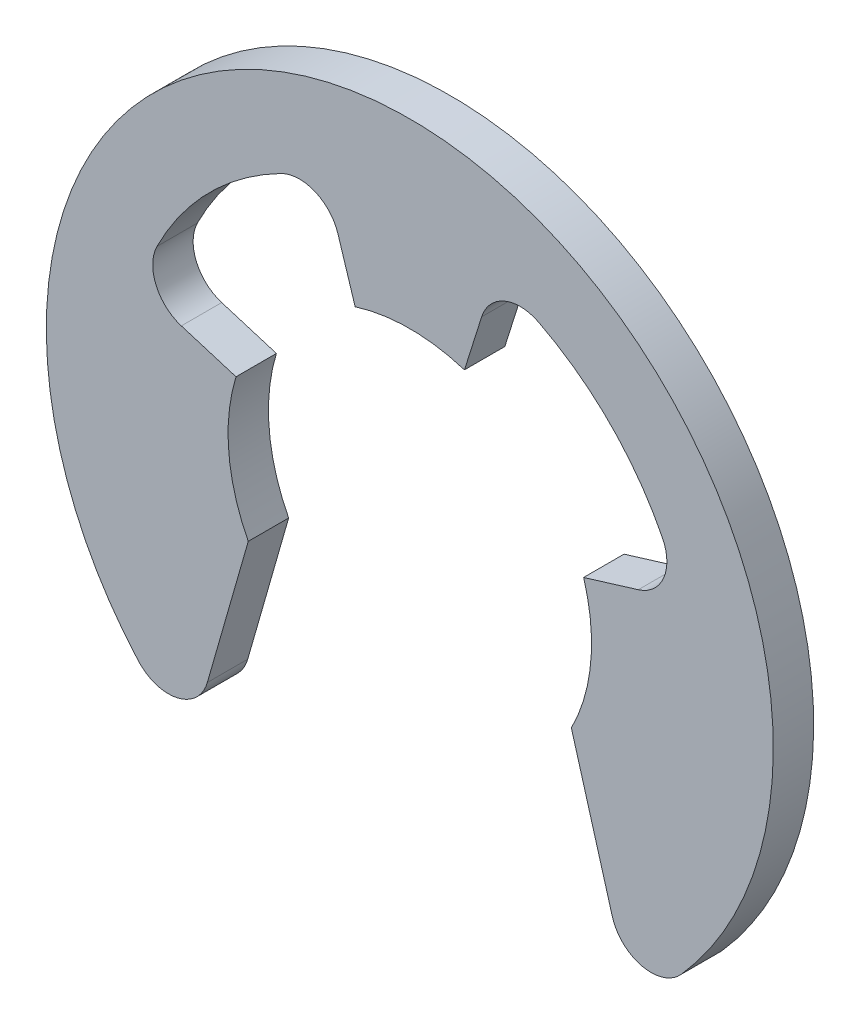
ISO-10303-21;
HEADER;
FILE_DESCRIPTION(('STEP AP214'),'2;1');
FILE_NAME('part.step','',(''),(''),'','','');
FILE_SCHEMA(('AUTOMOTIVE_DESIGN { 1 0 10303 214 1 1 1 1 }'));
ENDSEC;
DATA;
#1=APPLICATION_CONTEXT('core data for automotive mechanical design processes');
#2=APPLICATION_PROTOCOL_DEFINITION('international standard','automotive_design',2000,#1);
#3=PRODUCT_CONTEXT('',#1,'mechanical');
#4=PRODUCT('Part','Part','',(#3));
#5=PRODUCT_RELATED_PRODUCT_CATEGORY('part','',(#4));
#6=PRODUCT_DEFINITION_FORMATION('','',#4);
#7=PRODUCT_DEFINITION_CONTEXT('part definition',#1,'design');
#8=PRODUCT_DEFINITION('design','',#6,#7);
#9=PRODUCT_DEFINITION_SHAPE('','',#8);
#10=(LENGTH_UNIT() NAMED_UNIT(*) SI_UNIT(.MILLI.,.METRE.));
#11=(NAMED_UNIT(*) PLANE_ANGLE_UNIT() SI_UNIT($,.RADIAN.));
#12=(NAMED_UNIT(*) SI_UNIT($,.STERADIAN.) SOLID_ANGLE_UNIT());
#13=UNCERTAINTY_MEASURE_WITH_UNIT(LENGTH_MEASURE(1.E-05),#10,'distance_accuracy_value','');
#14=(GEOMETRIC_REPRESENTATION_CONTEXT(3) GLOBAL_UNCERTAINTY_ASSIGNED_CONTEXT((#13)) GLOBAL_UNIT_ASSIGNED_CONTEXT((#10,
#11,#12)) REPRESENTATION_CONTEXT('',''));
#15=CARTESIAN_POINT('',(0.,0.,0.));
#16=DIRECTION('',(0.,0.,1.));
#17=DIRECTION('',(1.,0.,0.));
#18=AXIS2_PLACEMENT_3D('',#15,#16,#17);
#19=CARTESIAN_POINT('',(0.,0.,1.));
#20=DIRECTION('',(0.,0.,-1.));
#21=DIRECTION('',(-1.,0.,0.));
#22=AXIS2_PLACEMENT_3D('',#19,#20,#21);
#23=CYLINDRICAL_SURFACE('',#22,7.);
#24=CARTESIAN_POINT('',(0.,0.,0.));
#25=DIRECTION('',(0.,0.,1.));
#26=DIRECTION('',(1.,0.,0.));
#27=AXIS2_PLACEMENT_3D('',#24,#25,#26);
#28=CIRCLE('',#27,7.);
#29=CARTESIAN_POINT('',(6.25940411659755,3.1336656019942,0.));
#30=VERTEX_POINT('',#29);
#31=CARTESIAN_POINT('',(3.18816919383231,6.23181973355285,0.));
#32=VERTEX_POINT('',#31);
#33=EDGE_CURVE('E198',#30,#32,#28,.T.);
#34=ORIENTED_EDGE('',*,*,#33,.F.);
#35=DIRECTION('',(0.,0.,-1.));
#36=VECTOR('',#35,1.);
#37=CARTESIAN_POINT('',(6.25940411659755,3.1336656019942,1.));
#38=LINE('',#37,#36);
#39=CARTESIAN_POINT('',(6.25940411659755,3.1336656019942,1.));
#40=VERTEX_POINT('',#39);
#41=EDGE_CURVE('E11',#40,#30,#38,.T.);
#42=ORIENTED_EDGE('',*,*,#41,.F.);
#43=CARTESIAN_POINT('',(0.,0.,1.));
#44=DIRECTION('',(0.,0.,1.));
#45=DIRECTION('',(1.,0.,0.));
#46=AXIS2_PLACEMENT_3D('',#43,#44,#45);
#47=CIRCLE('',#46,7.);
#48=CARTESIAN_POINT('',(3.18816919383231,6.23181973355285,1.));
#49=VERTEX_POINT('',#48);
#50=EDGE_CURVE('E249',#40,#49,#47,.T.);
#51=ORIENTED_EDGE('',*,*,#50,.T.);
#52=DIRECTION('',(0.,0.,-1.));
#53=VECTOR('',#52,1.);
#54=CARTESIAN_POINT('',(3.18816919383231,6.23181973355285,1.));
#55=LINE('',#54,#53);
#56=EDGE_CURVE('E58',#49,#32,#55,.T.);
#57=ORIENTED_EDGE('',*,*,#56,.T.);
#58=EDGE_LOOP('',(#34,#42,#51,#57));
#59=FACE_BOUND('',#58,.T.);
#60=ADVANCED_FACE('F42',(#59),#23,.F.);
#61=CARTESIAN_POINT('',(5.36520352851219,2.6859990874236,1.));
#62=DIRECTION('',(0.,0.,-1.));
#63=DIRECTION('',(-1.,0.,0.));
#64=AXIS2_PLACEMENT_3D('',#61,#62,#63);
#65=CYLINDRICAL_SURFACE('',#64,1.);
#66=CARTESIAN_POINT('',(5.36520352851219,2.6859990874236,0.));
#67=DIRECTION('',(0.,0.,1.));
#68=DIRECTION('',(1.,0.,0.));
#69=AXIS2_PLACEMENT_3D('',#66,#67,#68);
#70=CIRCLE('',#69,1.);
#71=CARTESIAN_POINT('',(5.65757523323492,1.72969433146056,0.));
#72=VERTEX_POINT('',#71);
#73=EDGE_CURVE('E200',#30,#72,#70,.F.);
#74=ORIENTED_EDGE('',*,*,#73,.T.);
#75=DIRECTION('',(0.,0.,-1.));
#76=VECTOR('',#75,1.);
#77=CARTESIAN_POINT('',(5.65757523323492,1.72969433146056,1.));
#78=LINE('',#77,#76);
#79=CARTESIAN_POINT('',(5.65757523323492,1.72969433146056,1.));
#80=VERTEX_POINT('',#79);
#81=EDGE_CURVE('E50',#80,#72,#78,.T.);
#82=ORIENTED_EDGE('',*,*,#81,.F.);
#83=CARTESIAN_POINT('',(5.36520352851219,2.6859990874236,1.));
#84=DIRECTION('',(0.,0.,1.));
#85=DIRECTION('',(1.,0.,0.));
#86=AXIS2_PLACEMENT_3D('',#83,#84,#85);
#87=CIRCLE('',#86,1.);
#88=EDGE_CURVE('E296',#40,#80,#87,.F.);
#89=ORIENTED_EDGE('',*,*,#88,.F.);
#90=ORIENTED_EDGE('',*,*,#41,.T.);
#91=EDGE_LOOP('',(#74,#82,#89,#90));
#92=FACE_BOUND('',#91,.T.);
#93=ADVANCED_FACE('F285',(#92),#65,.F.);
#94=CARTESIAN_POINT('',(0.,0.,1.));
#95=DIRECTION('',(-0.292371704722737,0.956304755963035,0.));
#96=DIRECTION('',(-0.956304755963035,-0.292371704722737,0.));
#97=AXIS2_PLACEMENT_3D('',#94,#95,#96);
#98=PLANE('',#97);
#99=DIRECTION('',(0.956304755963035,0.292371704722737,0.));
#100=VECTOR('',#99,1.);
#101=CARTESIAN_POINT('',(0.,0.,0.));
#102=LINE('',#101,#100);
#103=CARTESIAN_POINT('',(4.30337140183366,1.31567267125232,0.));
#104=VERTEX_POINT('',#103);
#105=EDGE_CURVE('E203',#104,#72,#102,.T.);
#106=ORIENTED_EDGE('',*,*,#105,.F.);
#107=DIRECTION('',(0.,0.,-1.));
#108=VECTOR('',#107,1.);
#109=CARTESIAN_POINT('',(4.30337140183366,1.31567267125232,1.));
#110=LINE('',#109,#108);
#111=CARTESIAN_POINT('',(4.30337140183366,1.31567267125232,1.));
#112=VERTEX_POINT('',#111);
#113=EDGE_CURVE('E275',#112,#104,#110,.T.);
#114=ORIENTED_EDGE('',*,*,#113,.F.);
#115=DIRECTION('',(0.956304755963035,0.292371704722737,0.));
#116=VECTOR('',#115,1.);
#117=CARTESIAN_POINT('',(0.,0.,1.));
#118=LINE('',#117,#116);
#119=EDGE_CURVE('E282',#112,#80,#118,.T.);
#120=ORIENTED_EDGE('',*,*,#119,.T.);
#121=ORIENTED_EDGE('',*,*,#81,.T.);
#122=EDGE_LOOP('',(#106,#114,#120,#121));
#123=FACE_BOUND('',#122,.T.);
#124=ADVANCED_FACE('F280',(#123),#98,.T.);
#125=CARTESIAN_POINT('',(0.,0.,1.));
#126=DIRECTION('',(0.,0.,-1.));
#127=DIRECTION('',(-1.,0.,0.));
#128=AXIS2_PLACEMENT_3D('',#125,#126,#127);
#129=CYLINDRICAL_SURFACE('',#128,4.5);
#130=CARTESIAN_POINT('',(0.,0.,0.));
#131=DIRECTION('',(0.,0.,1.));
#132=DIRECTION('',(1.,0.,0.));
#133=AXIS2_PLACEMENT_3D('',#130,#131,#132);
#134=CIRCLE('',#133,4.5);
#135=CARTESIAN_POINT('',(4.,-2.06155281280883,0.));
#136=VERTEX_POINT('',#135);
#137=EDGE_CURVE('E206',#136,#104,#134,.T.);
#138=ORIENTED_EDGE('',*,*,#137,.F.);
#139=DIRECTION('',(0.,0.,-1.));
#140=VECTOR('',#139,1.);
#141=CARTESIAN_POINT('',(4.,-2.06155281280883,1.));
#142=LINE('',#141,#140);
#143=CARTESIAN_POINT('',(4.,-2.06155281280883,1.));
#144=VERTEX_POINT('',#143);
#145=EDGE_CURVE('E273',#144,#136,#142,.T.);
#146=ORIENTED_EDGE('',*,*,#145,.F.);
#147=CARTESIAN_POINT('',(0.,0.,1.));
#148=DIRECTION('',(0.,0.,1.));
#149=DIRECTION('',(1.,0.,0.));
#150=AXIS2_PLACEMENT_3D('',#147,#148,#149);
#151=CIRCLE('',#150,4.5);
#152=EDGE_CURVE('E295',#144,#112,#151,.T.);
#153=ORIENTED_EDGE('',*,*,#152,.T.);
#154=ORIENTED_EDGE('',*,*,#113,.T.);
#155=EDGE_LOOP('',(#138,#146,#153,#154));
#156=FACE_BOUND('',#155,.T.);
#157=ADVANCED_FACE('F291',(#156),#129,.F.);
#158=CARTESIAN_POINT('',(3.1498679174421,0.903210091076205,1.));
#159=DIRECTION('',(0.961261695938321,0.275637355816992,0.));
#160=DIRECTION('',(-0.275637355816992,0.961261695938321,0.));
#161=AXIS2_PLACEMENT_3D('',#158,#159,#160);
#162=PLANE('',#161);
#163=DIRECTION('',(0.275637355816992,-0.961261695938321,0.));
#164=VECTOR('',#163,1.);
#165=CARTESIAN_POINT('',(3.1498679174421,0.903210091076205,0.));
#166=LINE('',#165,#164);
#167=CARTESIAN_POINT('',(5.01340745819447,-5.5957246200124,0.));
#168=VERTEX_POINT('',#167);
#169=EDGE_CURVE('E209',#136,#168,#166,.T.);
#170=ORIENTED_EDGE('',*,*,#169,.T.);
#171=DIRECTION('',(0.,0.,-1.));
#172=VECTOR('',#171,1.);
#173=CARTESIAN_POINT('',(5.01340745819447,-5.5957246200124,1.));
#174=LINE('',#173,#172);
#175=CARTESIAN_POINT('',(5.01340745819447,-5.5957246200124,1.));
#176=VERTEX_POINT('',#175);
#177=EDGE_CURVE('E271',#176,#168,#174,.T.);
#178=ORIENTED_EDGE('',*,*,#177,.F.);
#179=DIRECTION('',(0.275637355816992,-0.961261695938321,0.));
#180=VECTOR('',#179,1.);
#181=CARTESIAN_POINT('',(3.1498679174421,0.903210091076205,1.));
#182=LINE('',#181,#180);
#183=EDGE_CURVE('E298',#144,#176,#182,.T.);
#184=ORIENTED_EDGE('',*,*,#183,.F.);
#185=ORIENTED_EDGE('',*,*,#145,.T.);
#186=EDGE_LOOP('',(#170,#178,#184,#185));
#187=FACE_BOUND('',#186,.T.);
#188=ADVANCED_FACE('F358',(#187),#162,.F.);
#189=CARTESIAN_POINT('',(5.97466915413279,-5.32008726419541,1.));
#190=DIRECTION('',(0.,0.,-1.));
#191=DIRECTION('',(-1.,0.,0.));
#192=AXIS2_PLACEMENT_3D('',#189,#190,#191);
#193=CYLINDRICAL_SURFACE('',#192,1.);
#194=CARTESIAN_POINT('',(5.97466915413279,-5.32008726419541,0.));
#195=DIRECTION('',(0.,0.,1.));
#196=DIRECTION('',(1.,0.,0.));
#197=AXIS2_PLACEMENT_3D('',#194,#195,#196);
#198=CIRCLE('',#197,1.);
#199=CARTESIAN_POINT('',(6.72150279839938,-5.98509817221984,0.));
#200=VERTEX_POINT('',#199);
#201=EDGE_CURVE('E212',#200,#168,#198,.F.);
#202=ORIENTED_EDGE('',*,*,#201,.F.);
#203=DIRECTION('',(0.,0.,-1.));
#204=VECTOR('',#203,1.);
#205=CARTESIAN_POINT('',(6.72150279839938,-5.98509817221984,1.));
#206=LINE('',#205,#204);
#207=CARTESIAN_POINT('',(6.72150279839938,-5.98509817221984,1.));
#208=VERTEX_POINT('',#207);
#209=EDGE_CURVE('E269',#208,#200,#206,.T.);
#210=ORIENTED_EDGE('',*,*,#209,.F.);
#211=CARTESIAN_POINT('',(5.97466915413279,-5.32008726419541,1.));
#212=DIRECTION('',(0.,0.,1.));
#213=DIRECTION('',(1.,0.,0.));
#214=AXIS2_PLACEMENT_3D('',#211,#212,#213);
#215=CIRCLE('',#214,1.);
#216=EDGE_CURVE('E304',#208,#176,#215,.F.);
#217=ORIENTED_EDGE('',*,*,#216,.T.);
#218=ORIENTED_EDGE('',*,*,#177,.T.);
#219=EDGE_LOOP('',(#202,#210,#217,#218));
#220=FACE_BOUND('',#219,.T.);
#221=ADVANCED_FACE('F361',(#220),#193,.T.);
#222=CARTESIAN_POINT('',(0.,0.,1.));
#223=DIRECTION('',(0.,0.,-1.));
#224=DIRECTION('',(-1.,0.,0.));
#225=AXIS2_PLACEMENT_3D('',#222,#223,#224);
#226=CYLINDRICAL_SURFACE('',#225,9.);
#227=CARTESIAN_POINT('',(0.,0.,0.));
#228=DIRECTION('',(0.,0.,1.));
#229=DIRECTION('',(1.,0.,0.));
#230=AXIS2_PLACEMENT_3D('',#227,#228,#229);
#231=CIRCLE('',#230,9.);
#232=CARTESIAN_POINT('',(-6.72150279839939,-5.98509817221983,0.));
#233=VERTEX_POINT('',#232);
#234=EDGE_CURVE('E215',#200,#233,#231,.T.);
#235=ORIENTED_EDGE('',*,*,#234,.T.);
#236=DIRECTION('',(0.,0.,-1.));
#237=VECTOR('',#236,1.);
#238=CARTESIAN_POINT('',(-6.72150279839939,-5.98509817221983,1.));
#239=LINE('',#238,#237);
#240=CARTESIAN_POINT('',(-6.72150279839939,-5.98509817221983,1.));
#241=VERTEX_POINT('',#240);
#242=EDGE_CURVE('E267',#241,#233,#239,.T.);
#243=ORIENTED_EDGE('',*,*,#242,.F.);
#244=CARTESIAN_POINT('',(0.,0.,1.));
#245=DIRECTION('',(0.,0.,1.));
#246=DIRECTION('',(1.,0.,0.));
#247=AXIS2_PLACEMENT_3D('',#244,#245,#246);
#248=CIRCLE('',#247,9.);
#249=EDGE_CURVE('E307',#208,#241,#248,.T.);
#250=ORIENTED_EDGE('',*,*,#249,.F.);
#251=ORIENTED_EDGE('',*,*,#209,.T.);
#252=EDGE_LOOP('',(#235,#243,#250,#251));
#253=FACE_BOUND('',#252,.T.);
#254=ADVANCED_FACE('F365',(#253),#226,.T.);
#255=CARTESIAN_POINT('',(-5.97466915413279,-5.32008726419541,1.));
#256=DIRECTION('',(0.,0.,-1.));
#257=DIRECTION('',(-1.,0.,0.));
#258=AXIS2_PLACEMENT_3D('',#255,#256,#257);
#259=CYLINDRICAL_SURFACE('',#258,1.);
#260=CARTESIAN_POINT('',(-5.97466915413279,-5.32008726419541,0.));
#261=DIRECTION('',(0.,0.,1.));
#262=DIRECTION('',(1.,0.,0.));
#263=AXIS2_PLACEMENT_3D('',#260,#261,#262);
#264=CIRCLE('',#263,1.);
#265=CARTESIAN_POINT('',(-5.01340745819447,-5.5957246200124,0.));
#266=VERTEX_POINT('',#265);
#267=EDGE_CURVE('E219',#266,#233,#264,.F.);
#268=ORIENTED_EDGE('',*,*,#267,.F.);
#269=DIRECTION('',(0.,0.,-1.));
#270=VECTOR('',#269,1.);
#271=CARTESIAN_POINT('',(-5.01340745819447,-5.5957246200124,1.));
#272=LINE('',#271,#270);
#273=CARTESIAN_POINT('',(-5.01340745819447,-5.5957246200124,1.));
#274=VERTEX_POINT('',#273);
#275=EDGE_CURVE('E265',#274,#266,#272,.T.);
#276=ORIENTED_EDGE('',*,*,#275,.F.);
#277=CARTESIAN_POINT('',(-5.97466915413279,-5.32008726419541,1.));
#278=DIRECTION('',(0.,0.,1.));
#279=DIRECTION('',(1.,0.,0.));
#280=AXIS2_PLACEMENT_3D('',#277,#278,#279);
#281=CIRCLE('',#280,1.);
#282=EDGE_CURVE('E310',#274,#241,#281,.F.);
#283=ORIENTED_EDGE('',*,*,#282,.T.);
#284=ORIENTED_EDGE('',*,*,#242,.T.);
#285=EDGE_LOOP('',(#268,#276,#283,#284));
#286=FACE_BOUND('',#285,.T.);
#287=ADVANCED_FACE('F369',(#286),#259,.T.);
#288=CARTESIAN_POINT('',(-3.1498679174421,0.903210091076205,1.));
#289=DIRECTION('',(0.961261695938321,-0.275637355816992,0.));
#290=DIRECTION('',(0.275637355816992,0.961261695938321,0.));
#291=AXIS2_PLACEMENT_3D('',#288,#289,#290);
#292=PLANE('',#291);
#293=DIRECTION('',(-0.275637355816992,-0.961261695938321,0.));
#294=VECTOR('',#293,1.);
#295=CARTESIAN_POINT('',(-3.1498679174421,0.903210091076205,0.));
#296=LINE('',#295,#294);
#297=CARTESIAN_POINT('',(-4.,-2.06155281280883,0.));
#298=VERTEX_POINT('',#297);
#299=EDGE_CURVE('E222',#298,#266,#296,.T.);
#300=ORIENTED_EDGE('',*,*,#299,.F.);
#301=DIRECTION('',(0.,0.,-1.));
#302=VECTOR('',#301,1.);
#303=CARTESIAN_POINT('',(-4.,-2.06155281280883,1.));
#304=LINE('',#303,#302);
#305=CARTESIAN_POINT('',(-4.,-2.06155281280883,1.));
#306=VERTEX_POINT('',#305);
#307=EDGE_CURVE('E263',#306,#298,#304,.T.);
#308=ORIENTED_EDGE('',*,*,#307,.F.);
#309=DIRECTION('',(-0.275637355816992,-0.961261695938321,0.));
#310=VECTOR('',#309,1.);
#311=CARTESIAN_POINT('',(-3.1498679174421,0.903210091076205,1.));
#312=LINE('',#311,#310);
#313=EDGE_CURVE('E313',#306,#274,#312,.T.);
#314=ORIENTED_EDGE('',*,*,#313,.T.);
#315=ORIENTED_EDGE('',*,*,#275,.T.);
#316=EDGE_LOOP('',(#300,#308,#314,#315));
#317=FACE_BOUND('',#316,.T.);
#318=ADVANCED_FACE('F373',(#317),#292,.T.);
#319=CARTESIAN_POINT('',(0.,0.,1.));
#320=DIRECTION('',(0.,0.,-1.));
#321=DIRECTION('',(-1.,0.,0.));
#322=AXIS2_PLACEMENT_3D('',#319,#320,#321);
#323=CYLINDRICAL_SURFACE('',#322,4.5);
#324=CARTESIAN_POINT('',(0.,0.,0.));
#325=DIRECTION('',(0.,0.,1.));
#326=DIRECTION('',(1.,0.,0.));
#327=AXIS2_PLACEMENT_3D('',#324,#325,#326);
#328=CIRCLE('',#327,4.5);
#329=CARTESIAN_POINT('',(-4.30337140183367,1.31567267125229,0.));
#330=VERTEX_POINT('',#329);
#331=EDGE_CURVE('E225',#330,#298,#328,.T.);
#332=ORIENTED_EDGE('',*,*,#331,.F.);
#333=DIRECTION('',(0.,0.,-1.));
#334=VECTOR('',#333,1.);
#335=CARTESIAN_POINT('',(-4.30337140183367,1.31567267125229,1.));
#336=LINE('',#335,#334);
#337=CARTESIAN_POINT('',(-4.30337140183367,1.31567267125229,1.));
#338=VERTEX_POINT('',#337);
#339=EDGE_CURVE('E261',#338,#330,#336,.T.);
#340=ORIENTED_EDGE('',*,*,#339,.F.);
#341=CARTESIAN_POINT('',(0.,0.,1.));
#342=DIRECTION('',(0.,0.,1.));
#343=DIRECTION('',(1.,0.,0.));
#344=AXIS2_PLACEMENT_3D('',#341,#342,#343);
#345=CIRCLE('',#344,4.5);
#346=EDGE_CURVE('E316',#338,#306,#345,.T.);
#347=ORIENTED_EDGE('',*,*,#346,.T.);
#348=ORIENTED_EDGE('',*,*,#307,.T.);
#349=EDGE_LOOP('',(#332,#340,#347,#348));
#350=FACE_BOUND('',#349,.T.);
#351=ADVANCED_FACE('F377',(#350),#323,.F.);
#352=CARTESIAN_POINT('',(0.,0.,1.));
#353=DIRECTION('',(-0.292371704722731,-0.956304755963037,0.));
#354=DIRECTION('',(0.956304755963037,-0.292371704722731,0.));
#355=AXIS2_PLACEMENT_3D('',#352,#353,#354);
#356=PLANE('',#355);
#357=DIRECTION('',(-0.956304755963037,0.292371704722731,0.));
#358=VECTOR('',#357,1.);
#359=CARTESIAN_POINT('',(0.,0.,0.));
#360=LINE('',#359,#358);
#361=CARTESIAN_POINT('',(-5.65757523323494,1.72969433146052,0.));
#362=VERTEX_POINT('',#361);
#363=EDGE_CURVE('E228',#330,#362,#360,.T.);
#364=ORIENTED_EDGE('',*,*,#363,.T.);
#365=DIRECTION('',(0.,0.,-1.));
#366=VECTOR('',#365,1.);
#367=CARTESIAN_POINT('',(-5.65757523323494,1.72969433146052,1.));
#368=LINE('',#367,#366);
#369=CARTESIAN_POINT('',(-5.65757523323494,1.72969433146052,1.));
#370=VERTEX_POINT('',#369);
#371=EDGE_CURVE('E259',#370,#362,#368,.T.);
#372=ORIENTED_EDGE('',*,*,#371,.F.);
#373=DIRECTION('',(-0.956304755963037,0.292371704722731,0.));
#374=VECTOR('',#373,1.);
#375=CARTESIAN_POINT('',(0.,0.,1.));
#376=LINE('',#375,#374);
#377=EDGE_CURVE('E320',#338,#370,#376,.T.);
#378=ORIENTED_EDGE('',*,*,#377,.F.);
#379=ORIENTED_EDGE('',*,*,#339,.T.);
#380=EDGE_LOOP('',(#364,#372,#378,#379));
#381=FACE_BOUND('',#380,.T.);
#382=ADVANCED_FACE('F381',(#381),#356,.F.);
#383=CARTESIAN_POINT('',(-5.36520352851221,2.68599908742356,1.));
#384=DIRECTION('',(0.,0.,-1.));
#385=DIRECTION('',(-1.,0.,0.));
#386=AXIS2_PLACEMENT_3D('',#383,#384,#385);
#387=CYLINDRICAL_SURFACE('',#386,1.);
#388=CARTESIAN_POINT('',(-5.36520352851221,2.68599908742356,0.));
#389=DIRECTION('',(0.,0.,1.));
#390=DIRECTION('',(1.,0.,0.));
#391=AXIS2_PLACEMENT_3D('',#388,#389,#390);
#392=CIRCLE('',#391,1.);
#393=CARTESIAN_POINT('',(-6.25940411659757,3.13366560199415,0.));
#394=VERTEX_POINT('',#393);
#395=EDGE_CURVE('E231',#394,#362,#392,.T.);
#396=ORIENTED_EDGE('',*,*,#395,.F.);
#397=DIRECTION('',(0.,0.,-1.));
#398=VECTOR('',#397,1.);
#399=CARTESIAN_POINT('',(-6.25940411659757,3.13366560199415,1.));
#400=LINE('',#399,#398);
#401=CARTESIAN_POINT('',(-6.25940411659757,3.13366560199415,1.));
#402=VERTEX_POINT('',#401);
#403=EDGE_CURVE('E257',#402,#394,#400,.T.);
#404=ORIENTED_EDGE('',*,*,#403,.F.);
#405=CARTESIAN_POINT('',(-5.36520352851221,2.68599908742356,1.));
#406=DIRECTION('',(0.,0.,1.));
#407=DIRECTION('',(1.,0.,0.));
#408=AXIS2_PLACEMENT_3D('',#405,#406,#407);
#409=CIRCLE('',#408,1.);
#410=EDGE_CURVE('E322',#402,#370,#409,.T.);
#411=ORIENTED_EDGE('',*,*,#410,.T.);
#412=ORIENTED_EDGE('',*,*,#371,.T.);
#413=EDGE_LOOP('',(#396,#404,#411,#412));
#414=FACE_BOUND('',#413,.T.);
#415=ADVANCED_FACE('F385',(#414),#387,.F.);
#416=CARTESIAN_POINT('',(0.,0.,1.));
#417=DIRECTION('',(0.,0.,-1.));
#418=DIRECTION('',(-1.,0.,0.));
#419=AXIS2_PLACEMENT_3D('',#416,#417,#418);
#420=CYLINDRICAL_SURFACE('',#419,7.);
#421=CARTESIAN_POINT('',(0.,0.,0.));
#422=DIRECTION('',(0.,0.,1.));
#423=DIRECTION('',(1.,0.,0.));
#424=AXIS2_PLACEMENT_3D('',#421,#422,#423);
#425=CIRCLE('',#424,7.);
#426=CARTESIAN_POINT('',(-3.18816919383231,6.23181973355284,0.));
#427=VERTEX_POINT('',#426);
#428=EDGE_CURVE('E234',#427,#394,#425,.T.);
#429=ORIENTED_EDGE('',*,*,#428,.F.);
#430=DIRECTION('',(0.,0.,-1.));
#431=VECTOR('',#430,1.);
#432=CARTESIAN_POINT('',(-3.18816919383231,6.23181973355284,1.));
#433=LINE('',#432,#431);
#434=CARTESIAN_POINT('',(-3.18816919383231,6.23181973355284,1.));
#435=VERTEX_POINT('',#434);
#436=EDGE_CURVE('E255',#435,#427,#433,.T.);
#437=ORIENTED_EDGE('',*,*,#436,.F.);
#438=CARTESIAN_POINT('',(0.,0.,1.));
#439=DIRECTION('',(0.,0.,1.));
#440=DIRECTION('',(1.,0.,0.));
#441=AXIS2_PLACEMENT_3D('',#438,#439,#440);
#442=CIRCLE('',#441,7.);
#443=EDGE_CURVE('E325',#435,#402,#442,.T.);
#444=ORIENTED_EDGE('',*,*,#443,.T.);
#445=ORIENTED_EDGE('',*,*,#403,.T.);
#446=EDGE_LOOP('',(#429,#437,#444,#445));
#447=FACE_BOUND('',#446,.T.);
#448=ADVANCED_FACE('F389',(#447),#420,.F.);
#449=CARTESIAN_POINT('',(-2.73271645185627,5.34155977161672,1.));
#450=DIRECTION('',(0.,0.,-1.));
#451=DIRECTION('',(-1.,0.,0.));
#452=AXIS2_PLACEMENT_3D('',#449,#450,#451);
#453=CYLINDRICAL_SURFACE('',#452,1.);
#454=CARTESIAN_POINT('',(-2.73271645185627,5.34155977161672,0.));
#455=DIRECTION('',(0.,0.,1.));
#456=DIRECTION('',(1.,0.,0.));
#457=AXIS2_PLACEMENT_3D('',#454,#455,#456);
#458=CIRCLE('',#457,1.);
#459=CARTESIAN_POINT('',(-1.77899950110804,5.642265571121,0.));
#460=VERTEX_POINT('',#459);
#461=EDGE_CURVE('E237',#460,#427,#458,.T.);
#462=ORIENTED_EDGE('',*,*,#461,.F.);
#463=DIRECTION('',(0.,0.,-1.));
#464=VECTOR('',#463,1.);
#465=CARTESIAN_POINT('',(-1.77899950110804,5.642265571121,1.));
#466=LINE('',#465,#464);
#467=CARTESIAN_POINT('',(-1.77899950110804,5.642265571121,1.));
#468=VERTEX_POINT('',#467);
#469=EDGE_CURVE('E253',#468,#460,#466,.T.);
#470=ORIENTED_EDGE('',*,*,#469,.F.);
#471=CARTESIAN_POINT('',(-2.73271645185627,5.34155977161672,1.));
#472=DIRECTION('',(0.,0.,1.));
#473=DIRECTION('',(1.,0.,0.));
#474=AXIS2_PLACEMENT_3D('',#471,#472,#473);
#475=CIRCLE('',#474,1.);
#476=EDGE_CURVE('E193',#468,#435,#475,.T.);
#477=ORIENTED_EDGE('',*,*,#476,.T.);
#478=ORIENTED_EDGE('',*,*,#436,.T.);
#479=EDGE_LOOP('',(#462,#470,#477,#478));
#480=FACE_BOUND('',#479,.T.);
#481=ADVANCED_FACE('F330',(#480),#453,.F.);
#482=CARTESIAN_POINT('',(0.,0.,1.));
#483=DIRECTION('',(-0.953716950748227,-0.300705799504274,0.));
#484=DIRECTION('',(0.300705799504274,-0.953716950748227,0.));
#485=AXIS2_PLACEMENT_3D('',#482,#483,#484);
#486=PLANE('',#485);
#487=DIRECTION('',(-0.300705799504274,0.953716950748227,0.));
#488=VECTOR('',#487,1.);
#489=CARTESIAN_POINT('',(0.,0.,0.));
#490=LINE('',#489,#488);
#491=CARTESIAN_POINT('',(-1.35317609776923,4.29172627836702,0.));
#492=VERTEX_POINT('',#491);
#493=EDGE_CURVE('E240',#492,#460,#490,.T.);
#494=ORIENTED_EDGE('',*,*,#493,.F.);
#495=DIRECTION('',(0.,0.,-1.));
#496=VECTOR('',#495,1.);
#497=CARTESIAN_POINT('',(-1.35317609776923,4.29172627836702,1.));
#498=LINE('',#497,#496);
#499=CARTESIAN_POINT('',(-1.35317609776923,4.29172627836702,1.));
#500=VERTEX_POINT('',#499);
#501=EDGE_CURVE('E178',#500,#492,#498,.T.);
#502=ORIENTED_EDGE('',*,*,#501,.F.);
#503=DIRECTION('',(-0.300705799504274,0.953716950748227,0.));
#504=VECTOR('',#503,1.);
#505=CARTESIAN_POINT('',(0.,0.,1.));
#506=LINE('',#505,#504);
#507=EDGE_CURVE('E191',#500,#468,#506,.T.);
#508=ORIENTED_EDGE('',*,*,#507,.T.);
#509=ORIENTED_EDGE('',*,*,#469,.T.);
#510=EDGE_LOOP('',(#494,#502,#508,#509));
#511=FACE_BOUND('',#510,.T.);
#512=ADVANCED_FACE('F336',(#511),#486,.T.);
#513=CARTESIAN_POINT('',(0.,0.,1.));
#514=DIRECTION('',(0.,0.,-1.));
#515=DIRECTION('',(-1.,0.,0.));
#516=AXIS2_PLACEMENT_3D('',#513,#514,#515);
#517=CYLINDRICAL_SURFACE('',#516,4.5);
#518=CARTESIAN_POINT('',(0.,0.,0.));
#519=DIRECTION('',(0.,0.,1.));
#520=DIRECTION('',(1.,0.,0.));
#521=AXIS2_PLACEMENT_3D('',#518,#519,#520);
#522=CIRCLE('',#521,4.5);
#523=CARTESIAN_POINT('',(1.35317609776923,4.29172627836702,0.));
#524=VERTEX_POINT('',#523);
#525=EDGE_CURVE('E175',#524,#492,#522,.T.);
#526=ORIENTED_EDGE('',*,*,#525,.F.);
#527=DIRECTION('',(0.,0.,-1.));
#528=VECTOR('',#527,1.);
#529=CARTESIAN_POINT('',(1.35317609776923,4.29172627836702,1.));
#530=LINE('',#529,#528);
#531=CARTESIAN_POINT('',(1.35317609776923,4.29172627836702,1.));
#532=VERTEX_POINT('',#531);
#533=EDGE_CURVE('E169',#532,#524,#530,.T.);
#534=ORIENTED_EDGE('',*,*,#533,.F.);
#535=CARTESIAN_POINT('',(0.,0.,1.));
#536=DIRECTION('',(0.,0.,1.));
#537=DIRECTION('',(1.,0.,0.));
#538=AXIS2_PLACEMENT_3D('',#535,#536,#537);
#539=CIRCLE('',#538,4.5);
#540=EDGE_CURVE('E173',#532,#500,#539,.T.);
#541=ORIENTED_EDGE('',*,*,#540,.T.);
#542=ORIENTED_EDGE('',*,*,#501,.T.);
#543=EDGE_LOOP('',(#526,#534,#541,#542));
#544=FACE_BOUND('',#543,.T.);
#545=ADVANCED_FACE('F171',(#544),#517,.F.);
#546=CARTESIAN_POINT('',(0.,0.,1.));
#547=DIRECTION('',(-0.953716950748227,0.300705799504274,0.));
#548=DIRECTION('',(-0.300705799504274,-0.953716950748227,0.));
#549=AXIS2_PLACEMENT_3D('',#546,#547,#548);
#550=PLANE('',#549);
#551=DIRECTION('',(0.300705799504274,0.953716950748227,0.));
#552=VECTOR('',#551,1.);
#553=CARTESIAN_POINT('',(0.,0.,0.));
#554=LINE('',#553,#552);
#555=CARTESIAN_POINT('',(1.77899950110804,5.642265571121,0.));
#556=VERTEX_POINT('',#555);
#557=EDGE_CURVE('E244',#524,#556,#554,.T.);
#558=ORIENTED_EDGE('',*,*,#557,.T.);
#559=DIRECTION('',(0.,0.,-1.));
#560=VECTOR('',#559,1.);
#561=CARTESIAN_POINT('',(1.77899950110804,5.642265571121,1.));
#562=LINE('',#561,#560);
#563=CARTESIAN_POINT('',(1.77899950110804,5.642265571121,1.));
#564=VERTEX_POINT('',#563);
#565=EDGE_CURVE('E114',#564,#556,#562,.T.);
#566=ORIENTED_EDGE('',*,*,#565,.F.);
#567=DIRECTION('',(0.300705799504274,0.953716950748227,0.));
#568=VECTOR('',#567,1.);
#569=CARTESIAN_POINT('',(0.,0.,1.));
#570=LINE('',#569,#568);
#571=EDGE_CURVE('E180',#532,#564,#570,.T.);
#572=ORIENTED_EDGE('',*,*,#571,.F.);
#573=ORIENTED_EDGE('',*,*,#533,.T.);
#574=EDGE_LOOP('',(#558,#566,#572,#573));
#575=FACE_BOUND('',#574,.T.);
#576=ADVANCED_FACE('F181',(#575),#550,.F.);
#577=CARTESIAN_POINT('',(2.73271645185627,5.34155977161672,1.));
#578=DIRECTION('',(0.,0.,-1.));
#579=DIRECTION('',(-1.,0.,0.));
#580=AXIS2_PLACEMENT_3D('',#577,#578,#579);
#581=CYLINDRICAL_SURFACE('',#580,1.);
#582=CARTESIAN_POINT('',(2.73271645185627,5.34155977161672,0.));
#583=DIRECTION('',(0.,0.,1.));
#584=DIRECTION('',(1.,0.,0.));
#585=AXIS2_PLACEMENT_3D('',#582,#583,#584);
#586=CIRCLE('',#585,1.);
#587=EDGE_CURVE('E246',#32,#556,#586,.T.);
#588=ORIENTED_EDGE('',*,*,#587,.F.);
#589=ORIENTED_EDGE('',*,*,#56,.F.);
#590=CARTESIAN_POINT('',(2.73271645185627,5.34155977161672,1.));
#591=DIRECTION('',(0.,0.,1.));
#592=DIRECTION('',(1.,0.,0.));
#593=AXIS2_PLACEMENT_3D('',#590,#591,#592);
#594=CIRCLE('',#593,1.);
#595=EDGE_CURVE('E184',#49,#564,#594,.T.);
#596=ORIENTED_EDGE('',*,*,#595,.T.);
#597=ORIENTED_EDGE('',*,*,#565,.T.);
#598=EDGE_LOOP('',(#588,#589,#596,#597));
#599=FACE_BOUND('',#598,.T.);
#600=ADVANCED_FACE('F337',(#599),#581,.F.);
#601=CARTESIAN_POINT('',(0.,0.,1.));
#602=DIRECTION('',(0.,0.,1.));
#603=DIRECTION('',(1.,0.,0.));
#604=AXIS2_PLACEMENT_3D('',#601,#602,#603);
#605=PLANE('',#604);
#606=ORIENTED_EDGE('',*,*,#50,.F.);
#607=ORIENTED_EDGE('',*,*,#88,.T.);
#608=ORIENTED_EDGE('',*,*,#119,.F.);
#609=ORIENTED_EDGE('',*,*,#152,.F.);
#610=ORIENTED_EDGE('',*,*,#183,.T.);
#611=ORIENTED_EDGE('',*,*,#216,.F.);
#612=ORIENTED_EDGE('',*,*,#249,.T.);
#613=ORIENTED_EDGE('',*,*,#282,.F.);
#614=ORIENTED_EDGE('',*,*,#313,.F.);
#615=ORIENTED_EDGE('',*,*,#346,.F.);
#616=ORIENTED_EDGE('',*,*,#377,.T.);
#617=ORIENTED_EDGE('',*,*,#410,.F.);
#618=ORIENTED_EDGE('',*,*,#443,.F.);
#619=ORIENTED_EDGE('',*,*,#476,.F.);
#620=ORIENTED_EDGE('',*,*,#507,.F.);
#621=ORIENTED_EDGE('',*,*,#540,.F.);
#622=ORIENTED_EDGE('',*,*,#571,.T.);
#623=ORIENTED_EDGE('',*,*,#595,.F.);
#624=EDGE_LOOP('',(#606,#607,#608,#609,#610,#611,#612,#613,#614,#615,#616,#617,#618,#619,#620,
#621,#622,#623));
#625=FACE_BOUND('',#624,.T.);
#626=ADVANCED_FACE('F188',(#625),#605,.T.);
#627=CARTESIAN_POINT('',(0.,0.,0.));
#628=DIRECTION('',(0.,0.,1.));
#629=DIRECTION('',(1.,0.,0.));
#630=AXIS2_PLACEMENT_3D('',#627,#628,#629);
#631=PLANE('',#630);
#632=ORIENTED_EDGE('',*,*,#33,.T.);
#633=ORIENTED_EDGE('',*,*,#587,.T.);
#634=ORIENTED_EDGE('',*,*,#557,.F.);
#635=ORIENTED_EDGE('',*,*,#525,.T.);
#636=ORIENTED_EDGE('',*,*,#493,.T.);
#637=ORIENTED_EDGE('',*,*,#461,.T.);
#638=ORIENTED_EDGE('',*,*,#428,.T.);
#639=ORIENTED_EDGE('',*,*,#395,.T.);
#640=ORIENTED_EDGE('',*,*,#363,.F.);
#641=ORIENTED_EDGE('',*,*,#331,.T.);
#642=ORIENTED_EDGE('',*,*,#299,.T.);
#643=ORIENTED_EDGE('',*,*,#267,.T.);
#644=ORIENTED_EDGE('',*,*,#234,.F.);
#645=ORIENTED_EDGE('',*,*,#201,.T.);
#646=ORIENTED_EDGE('',*,*,#169,.F.);
#647=ORIENTED_EDGE('',*,*,#137,.T.);
#648=ORIENTED_EDGE('',*,*,#105,.T.);
#649=ORIENTED_EDGE('',*,*,#73,.F.);
#650=EDGE_LOOP('',(#632,#633,#634,#635,#636,#637,#638,#639,#640,#641,#642,#643,#644,#645,#646,
#647,#648,#649));
#651=FACE_BOUND('',#650,.T.);
#652=ADVANCED_FACE('F287',(#651),#631,.F.);
#653=CLOSED_SHELL('',(#60,#93,#124,#157,#188,#221,#254,#287,#318,#351,#382,#415,#448,#481,#512,
#545,#576,#600,#626,#652));
#654=MANIFOLD_SOLID_BREP('B2',#653);
#655=ADVANCED_BREP_SHAPE_REPRESENTATION('',(#18,#654),#14);
#656=SHAPE_DEFINITION_REPRESENTATION(#9,#655);
ENDSEC;
END-ISO-10303-21;
